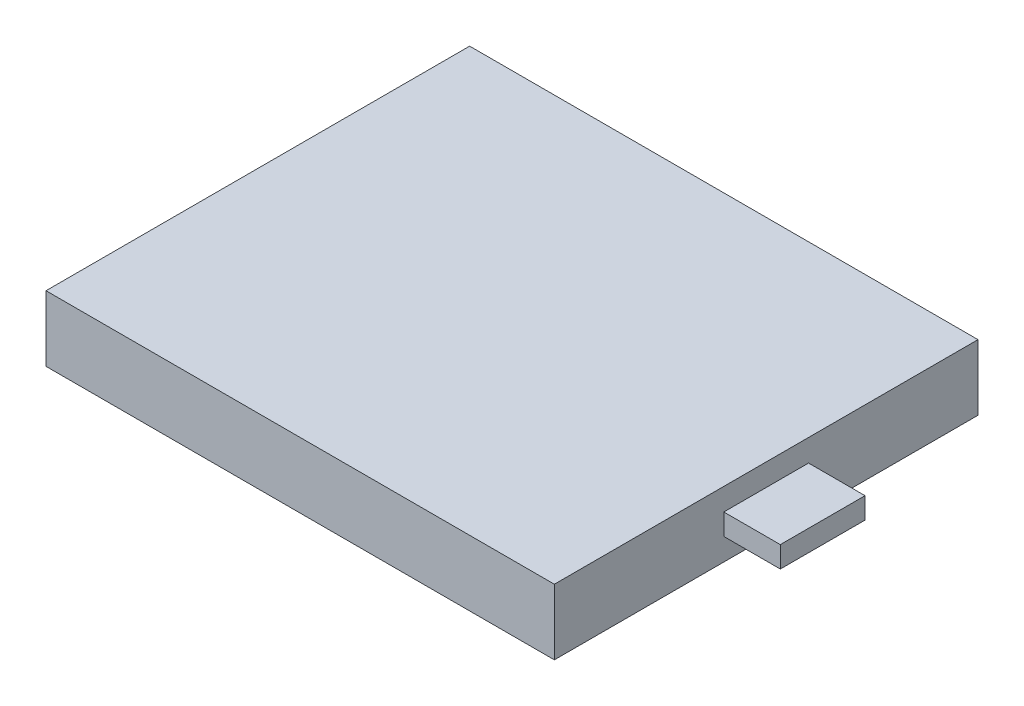
ISO-10303-21;
HEADER;
FILE_DESCRIPTION(('STEP AP214'),'2;1');
FILE_NAME('part.step','',(''),(''),'','','');
FILE_SCHEMA(('AUTOMOTIVE_DESIGN { 1 0 10303 214 1 1 1 1 }'));
ENDSEC;
DATA;
#1=APPLICATION_CONTEXT('core data for automotive mechanical design processes');
#2=APPLICATION_PROTOCOL_DEFINITION('international standard','automotive_design',2000,#1);
#3=PRODUCT_CONTEXT('',#1,'mechanical');
#4=PRODUCT('Part','Part','',(#3));
#5=PRODUCT_RELATED_PRODUCT_CATEGORY('part','',(#4));
#6=PRODUCT_DEFINITION_FORMATION('','',#4);
#7=PRODUCT_DEFINITION_CONTEXT('part definition',#1,'design');
#8=PRODUCT_DEFINITION('design','',#6,#7);
#9=PRODUCT_DEFINITION_SHAPE('','',#8);
#10=(LENGTH_UNIT() NAMED_UNIT(*) SI_UNIT(.MILLI.,.METRE.));
#11=(NAMED_UNIT(*) PLANE_ANGLE_UNIT() SI_UNIT($,.RADIAN.));
#12=(NAMED_UNIT(*) SI_UNIT($,.STERADIAN.) SOLID_ANGLE_UNIT());
#13=UNCERTAINTY_MEASURE_WITH_UNIT(LENGTH_MEASURE(1.E-05),#10,'distance_accuracy_value','');
#14=(GEOMETRIC_REPRESENTATION_CONTEXT(3) GLOBAL_UNCERTAINTY_ASSIGNED_CONTEXT((#13)) GLOBAL_UNIT_ASSIGNED_CONTEXT((#10,
#11,#12)) REPRESENTATION_CONTEXT('',''));
#15=CARTESIAN_POINT('',(0.,0.,0.));
#16=DIRECTION('',(0.,0.,1.));
#17=DIRECTION('',(1.,0.,0.));
#18=AXIS2_PLACEMENT_3D('',#15,#16,#17);
#19=CARTESIAN_POINT('',(0.,4.64,0.));
#20=DIRECTION('',(1.,0.,0.));
#21=DIRECTION('',(0.,0.,-1.));
#22=AXIS2_PLACEMENT_3D('',#19,#20,#21);
#23=PLANE('',#22);
#24=DIRECTION('',(0.,0.,1.));
#25=VECTOR('',#24,1.);
#26=CARTESIAN_POINT('',(0.,0.,0.));
#27=LINE('',#26,#25);
#28=CARTESIAN_POINT('',(0.,0.,-30.));
#29=VERTEX_POINT('',#28);
#30=CARTESIAN_POINT('',(0.,0.,0.));
#31=VERTEX_POINT('',#30);
#32=EDGE_CURVE('E129',#29,#31,#27,.T.);
#33=ORIENTED_EDGE('',*,*,#32,.T.);
#34=DIRECTION('',(0.,-1.,0.));
#35=VECTOR('',#34,1.);
#36=CARTESIAN_POINT('',(0.,4.64,0.));
#37=LINE('',#36,#35);
#38=CARTESIAN_POINT('',(0.,4.64,0.));
#39=VERTEX_POINT('',#38);
#40=EDGE_CURVE('E11',#39,#31,#37,.T.);
#41=ORIENTED_EDGE('',*,*,#40,.F.);
#42=DIRECTION('',(0.,0.,1.));
#43=VECTOR('',#42,1.);
#44=CARTESIAN_POINT('',(0.,4.64,0.));
#45=LINE('',#44,#43);
#46=CARTESIAN_POINT('',(0.,4.64,-30.));
#47=VERTEX_POINT('',#46);
#48=EDGE_CURVE('E134',#47,#39,#45,.T.);
#49=ORIENTED_EDGE('',*,*,#48,.F.);
#50=DIRECTION('',(0.,-1.,0.));
#51=VECTOR('',#50,1.);
#52=CARTESIAN_POINT('',(0.,4.64,-30.));
#53=LINE('',#52,#51);
#54=EDGE_CURVE('E144',#47,#29,#53,.T.);
#55=ORIENTED_EDGE('',*,*,#54,.T.);
#56=EDGE_LOOP('',(#33,#41,#49,#55));
#57=FACE_BOUND('',#56,.T.);
#58=ADVANCED_FACE('F33',(#57),#23,.F.);
#59=CARTESIAN_POINT('',(0.,4.64,0.));
#60=DIRECTION('',(0.,0.,-1.));
#61=DIRECTION('',(-1.,0.,0.));
#62=AXIS2_PLACEMENT_3D('',#59,#60,#61);
#63=PLANE('',#62);
#64=DIRECTION('',(1.,0.,0.));
#65=VECTOR('',#64,1.);
#66=CARTESIAN_POINT('',(0.,0.,0.));
#67=LINE('',#66,#65);
#68=CARTESIAN_POINT('',(36.,0.,0.));
#69=VERTEX_POINT('',#68);
#70=EDGE_CURVE('E147',#31,#69,#67,.T.);
#71=ORIENTED_EDGE('',*,*,#70,.T.);
#72=DIRECTION('',(0.,-1.,0.));
#73=VECTOR('',#72,1.);
#74=CARTESIAN_POINT('',(36.,4.64,0.));
#75=LINE('',#74,#73);
#76=CARTESIAN_POINT('',(36.,4.64,0.));
#77=VERTEX_POINT('',#76);
#78=EDGE_CURVE('E40',#77,#69,#75,.T.);
#79=ORIENTED_EDGE('',*,*,#78,.F.);
#80=DIRECTION('',(1.,0.,0.));
#81=VECTOR('',#80,1.);
#82=CARTESIAN_POINT('',(0.,4.64,0.));
#83=LINE('',#82,#81);
#84=EDGE_CURVE('E137',#39,#77,#83,.T.);
#85=ORIENTED_EDGE('',*,*,#84,.F.);
#86=ORIENTED_EDGE('',*,*,#40,.T.);
#87=EDGE_LOOP('',(#71,#79,#85,#86));
#88=FACE_BOUND('',#87,.T.);
#89=ADVANCED_FACE('F177',(#88),#63,.F.);
#90=CARTESIAN_POINT('',(36.,4.64,0.));
#91=DIRECTION('',(-1.,0.,0.));
#92=DIRECTION('',(0.,0.,1.));
#93=AXIS2_PLACEMENT_3D('',#90,#91,#92);
#94=PLANE('',#93);
#95=DIRECTION('',(0.,0.,-1.));
#96=VECTOR('',#95,1.);
#97=CARTESIAN_POINT('',(36.,1.57,-12.));
#98=LINE('',#97,#96);
#99=CARTESIAN_POINT('',(36.,1.57,-12.));
#100=VERTEX_POINT('',#99);
#101=CARTESIAN_POINT('',(36.,1.57,-18.));
#102=VERTEX_POINT('',#101);
#103=EDGE_CURVE('E116',#100,#102,#98,.T.);
#104=ORIENTED_EDGE('',*,*,#103,.F.);
#105=DIRECTION('',(0.,1.,0.));
#106=VECTOR('',#105,1.);
#107=CARTESIAN_POINT('',(36.,1.57,-12.));
#108=LINE('',#107,#106);
#109=CARTESIAN_POINT('',(36.,3.07,-12.));
#110=VERTEX_POINT('',#109);
#111=EDGE_CURVE('E47',#100,#110,#108,.T.);
#112=ORIENTED_EDGE('',*,*,#111,.T.);
#113=DIRECTION('',(0.,0.,-1.));
#114=VECTOR('',#113,1.);
#115=CARTESIAN_POINT('',(36.,3.07,-12.));
#116=LINE('',#115,#114);
#117=CARTESIAN_POINT('',(36.,3.07,-18.));
#118=VERTEX_POINT('',#117);
#119=EDGE_CURVE('E52',#110,#118,#116,.T.);
#120=ORIENTED_EDGE('',*,*,#119,.T.);
#121=DIRECTION('',(0.,1.,0.));
#122=VECTOR('',#121,1.);
#123=CARTESIAN_POINT('',(36.,1.57,-18.));
#124=LINE('',#123,#122);
#125=EDGE_CURVE('E119',#102,#118,#124,.T.);
#126=ORIENTED_EDGE('',*,*,#125,.F.);
#127=EDGE_LOOP('',(#104,#112,#120,#126));
#128=FACE_BOUND('',#127,.T.);
#129=DIRECTION('',(0.,0.,-1.));
#130=VECTOR('',#129,1.);
#131=CARTESIAN_POINT('',(36.,0.,0.));
#132=LINE('',#131,#130);
#133=CARTESIAN_POINT('',(36.,0.,-30.));
#134=VERTEX_POINT('',#133);
#135=EDGE_CURVE('E149',#69,#134,#132,.T.);
#136=ORIENTED_EDGE('',*,*,#135,.T.);
#137=DIRECTION('',(0.,-1.,0.));
#138=VECTOR('',#137,1.);
#139=CARTESIAN_POINT('',(36.,4.64,-30.));
#140=LINE('',#139,#138);
#141=CARTESIAN_POINT('',(36.,4.64,-30.));
#142=VERTEX_POINT('',#141);
#143=EDGE_CURVE('E154',#142,#134,#140,.T.);
#144=ORIENTED_EDGE('',*,*,#143,.F.);
#145=DIRECTION('',(0.,0.,-1.));
#146=VECTOR('',#145,1.);
#147=CARTESIAN_POINT('',(36.,4.64,0.));
#148=LINE('',#147,#146);
#149=EDGE_CURVE('E140',#77,#142,#148,.T.);
#150=ORIENTED_EDGE('',*,*,#149,.F.);
#151=ORIENTED_EDGE('',*,*,#78,.T.);
#152=EDGE_LOOP('',(#136,#144,#150,#151));
#153=FACE_BOUND('',#152,.T.);
#154=ADVANCED_FACE('F161',(#128,#153),#94,.F.);
#155=CARTESIAN_POINT('',(0.,4.64,-30.));
#156=DIRECTION('',(0.,0.,1.));
#157=DIRECTION('',(1.,0.,0.));
#158=AXIS2_PLACEMENT_3D('',#155,#156,#157);
#159=PLANE('',#158);
#160=DIRECTION('',(-1.,0.,0.));
#161=VECTOR('',#160,1.);
#162=CARTESIAN_POINT('',(0.,0.,-30.));
#163=LINE('',#162,#161);
#164=EDGE_CURVE('E138',#134,#29,#163,.T.);
#165=ORIENTED_EDGE('',*,*,#164,.T.);
#166=ORIENTED_EDGE('',*,*,#54,.F.);
#167=DIRECTION('',(-1.,0.,0.));
#168=VECTOR('',#167,1.);
#169=CARTESIAN_POINT('',(0.,4.64,-30.));
#170=LINE('',#169,#168);
#171=EDGE_CURVE('E142',#142,#47,#170,.T.);
#172=ORIENTED_EDGE('',*,*,#171,.F.);
#173=ORIENTED_EDGE('',*,*,#143,.T.);
#174=EDGE_LOOP('',(#165,#166,#172,#173));
#175=FACE_BOUND('',#174,.T.);
#176=ADVANCED_FACE('F170',(#175),#159,.F.);
#177=CARTESIAN_POINT('',(0.,4.64,0.));
#178=DIRECTION('',(0.,-1.,0.));
#179=DIRECTION('',(0.,0.,-1.));
#180=AXIS2_PLACEMENT_3D('',#177,#178,#179);
#181=PLANE('',#180);
#182=ORIENTED_EDGE('',*,*,#48,.T.);
#183=ORIENTED_EDGE('',*,*,#84,.T.);
#184=ORIENTED_EDGE('',*,*,#149,.T.);
#185=ORIENTED_EDGE('',*,*,#171,.T.);
#186=EDGE_LOOP('',(#182,#183,#184,#185));
#187=FACE_BOUND('',#186,.T.);
#188=ADVANCED_FACE('F176',(#187),#181,.F.);
#189=CARTESIAN_POINT('',(0.,0.,0.));
#190=DIRECTION('',(0.,-1.,0.));
#191=DIRECTION('',(0.,0.,-1.));
#192=AXIS2_PLACEMENT_3D('',#189,#190,#191);
#193=PLANE('',#192);
#194=ORIENTED_EDGE('',*,*,#32,.F.);
#195=ORIENTED_EDGE('',*,*,#164,.F.);
#196=ORIENTED_EDGE('',*,*,#135,.F.);
#197=ORIENTED_EDGE('',*,*,#70,.F.);
#198=EDGE_LOOP('',(#194,#195,#196,#197));
#199=FACE_BOUND('',#198,.T.);
#200=ADVANCED_FACE('F167',(#199),#193,.T.);
#201=CARTESIAN_POINT('',(40.,1.57,-12.));
#202=DIRECTION('',(0.,0.,1.));
#203=DIRECTION('',(1.,0.,0.));
#204=AXIS2_PLACEMENT_3D('',#201,#202,#203);
#205=PLANE('',#204);
#206=ORIENTED_EDGE('',*,*,#111,.F.);
#207=DIRECTION('',(-1.,0.,0.));
#208=VECTOR('',#207,1.);
#209=CARTESIAN_POINT('',(40.,1.57,-12.));
#210=LINE('',#209,#208);
#211=CARTESIAN_POINT('',(40.,1.57,-12.));
#212=VERTEX_POINT('',#211);
#213=EDGE_CURVE('E114',#212,#100,#210,.T.);
#214=ORIENTED_EDGE('',*,*,#213,.F.);
#215=DIRECTION('',(0.,1.,0.));
#216=VECTOR('',#215,1.);
#217=CARTESIAN_POINT('',(40.,1.57,-12.));
#218=LINE('',#217,#216);
#219=CARTESIAN_POINT('',(40.,3.07,-12.));
#220=VERTEX_POINT('',#219);
#221=EDGE_CURVE('E107',#212,#220,#218,.T.);
#222=ORIENTED_EDGE('',*,*,#221,.T.);
#223=DIRECTION('',(-1.,0.,0.));
#224=VECTOR('',#223,1.);
#225=CARTESIAN_POINT('',(40.,3.07,-12.));
#226=LINE('',#225,#224);
#227=EDGE_CURVE('E95',#220,#110,#226,.T.);
#228=ORIENTED_EDGE('',*,*,#227,.T.);
#229=EDGE_LOOP('',(#206,#214,#222,#228));
#230=FACE_BOUND('',#229,.T.);
#231=ADVANCED_FACE('F112',(#230),#205,.T.);
#232=CARTESIAN_POINT('',(40.,1.57,-12.));
#233=DIRECTION('',(0.,1.,0.));
#234=DIRECTION('',(0.,0.,1.));
#235=AXIS2_PLACEMENT_3D('',#232,#233,#234);
#236=PLANE('',#235);
#237=ORIENTED_EDGE('',*,*,#103,.T.);
#238=DIRECTION('',(-1.,0.,0.));
#239=VECTOR('',#238,1.);
#240=CARTESIAN_POINT('',(40.,1.57,-18.));
#241=LINE('',#240,#239);
#242=CARTESIAN_POINT('',(40.,1.57,-18.));
#243=VERTEX_POINT('',#242);
#244=EDGE_CURVE('E130',#243,#102,#241,.T.);
#245=ORIENTED_EDGE('',*,*,#244,.F.);
#246=DIRECTION('',(0.,0.,-1.));
#247=VECTOR('',#246,1.);
#248=CARTESIAN_POINT('',(40.,1.57,-12.));
#249=LINE('',#248,#247);
#250=EDGE_CURVE('E102',#212,#243,#249,.T.);
#251=ORIENTED_EDGE('',*,*,#250,.F.);
#252=ORIENTED_EDGE('',*,*,#213,.T.);
#253=EDGE_LOOP('',(#237,#245,#251,#252));
#254=FACE_BOUND('',#253,.T.);
#255=ADVANCED_FACE('F193',(#254),#236,.F.);
#256=CARTESIAN_POINT('',(40.,1.57,-18.));
#257=DIRECTION('',(0.,0.,1.));
#258=DIRECTION('',(1.,0.,0.));
#259=AXIS2_PLACEMENT_3D('',#256,#257,#258);
#260=PLANE('',#259);
#261=ORIENTED_EDGE('',*,*,#125,.T.);
#262=DIRECTION('',(-1.,0.,0.));
#263=VECTOR('',#262,1.);
#264=CARTESIAN_POINT('',(40.,3.07,-18.));
#265=LINE('',#264,#263);
#266=CARTESIAN_POINT('',(40.,3.07,-18.));
#267=VERTEX_POINT('',#266);
#268=EDGE_CURVE('E101',#267,#118,#265,.T.);
#269=ORIENTED_EDGE('',*,*,#268,.F.);
#270=DIRECTION('',(0.,1.,0.));
#271=VECTOR('',#270,1.);
#272=CARTESIAN_POINT('',(40.,1.57,-18.));
#273=LINE('',#272,#271);
#274=EDGE_CURVE('E109',#243,#267,#273,.T.);
#275=ORIENTED_EDGE('',*,*,#274,.F.);
#276=ORIENTED_EDGE('',*,*,#244,.T.);
#277=EDGE_LOOP('',(#261,#269,#275,#276));
#278=FACE_BOUND('',#277,.T.);
#279=ADVANCED_FACE('F196',(#278),#260,.F.);
#280=CARTESIAN_POINT('',(40.,3.07,-12.));
#281=DIRECTION('',(0.,1.,0.));
#282=DIRECTION('',(0.,0.,1.));
#283=AXIS2_PLACEMENT_3D('',#280,#281,#282);
#284=PLANE('',#283);
#285=ORIENTED_EDGE('',*,*,#119,.F.);
#286=ORIENTED_EDGE('',*,*,#227,.F.);
#287=DIRECTION('',(0.,0.,-1.));
#288=VECTOR('',#287,1.);
#289=CARTESIAN_POINT('',(40.,3.07,-12.));
#290=LINE('',#289,#288);
#291=EDGE_CURVE('E98',#220,#267,#290,.T.);
#292=ORIENTED_EDGE('',*,*,#291,.T.);
#293=ORIENTED_EDGE('',*,*,#268,.T.);
#294=EDGE_LOOP('',(#285,#286,#292,#293));
#295=FACE_BOUND('',#294,.T.);
#296=ADVANCED_FACE('F97',(#295),#284,.T.);
#297=CARTESIAN_POINT('',(40.,0.,0.));
#298=DIRECTION('',(-1.,0.,0.));
#299=DIRECTION('',(0.,0.,1.));
#300=AXIS2_PLACEMENT_3D('',#297,#298,#299);
#301=PLANE('',#300);
#302=ORIENTED_EDGE('',*,*,#221,.F.);
#303=ORIENTED_EDGE('',*,*,#250,.T.);
#304=ORIENTED_EDGE('',*,*,#274,.T.);
#305=ORIENTED_EDGE('',*,*,#291,.F.);
#306=EDGE_LOOP('',(#302,#303,#304,#305));
#307=FACE_BOUND('',#306,.T.);
#308=ADVANCED_FACE('F106',(#307),#301,.F.);
#309=CLOSED_SHELL('',(#58,#89,#154,#176,#188,#200,#231,#255,#279,#296,#308));
#310=MANIFOLD_SOLID_BREP('B2',#309);
#311=ADVANCED_BREP_SHAPE_REPRESENTATION('',(#18,#310),#14);
#312=SHAPE_DEFINITION_REPRESENTATION(#9,#311);
ENDSEC;
END-ISO-10303-21;
